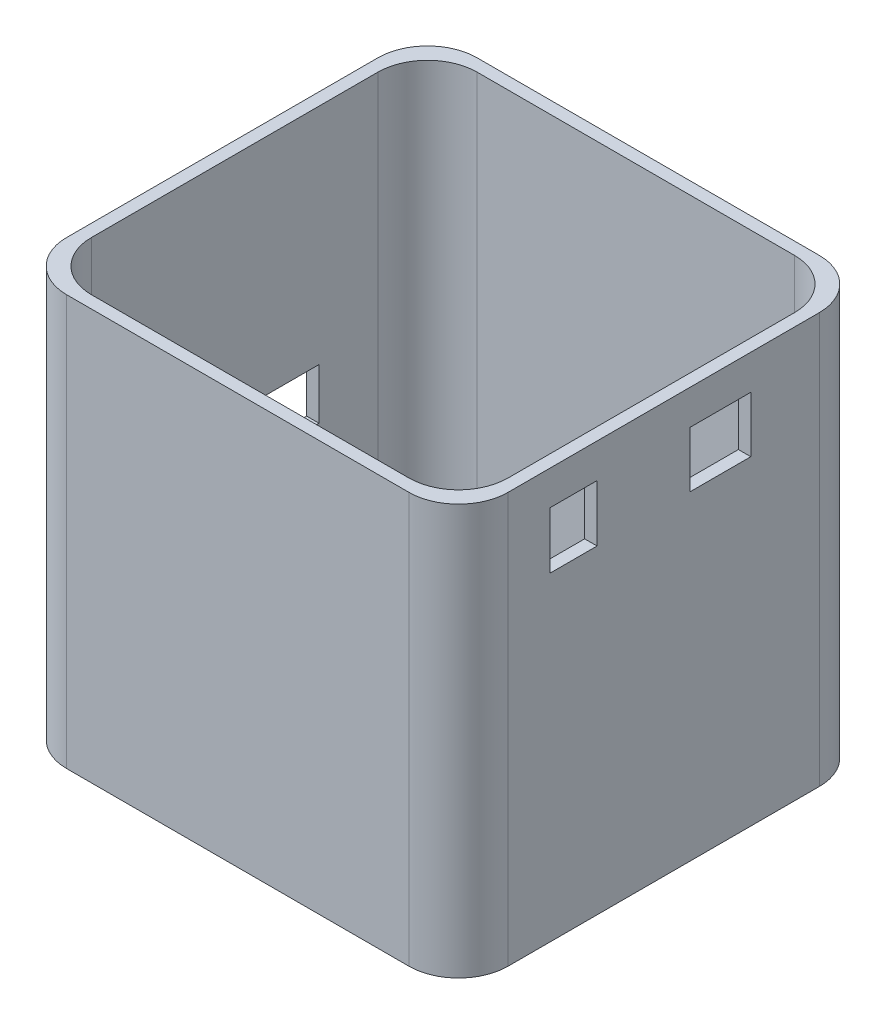
ISO-10303-21;
HEADER;
FILE_DESCRIPTION(('STEP AP214'),'2;1');
FILE_NAME('part.step','',(''),(''),'','','');
FILE_SCHEMA(('AUTOMOTIVE_DESIGN { 1 0 10303 214 1 1 1 1 }'));
ENDSEC;
DATA;
#1=APPLICATION_CONTEXT('core data for automotive mechanical design processes');
#2=APPLICATION_PROTOCOL_DEFINITION('international standard','automotive_design',2000,#1);
#3=PRODUCT_CONTEXT('',#1,'mechanical');
#4=PRODUCT('Part','Part','',(#3));
#5=PRODUCT_RELATED_PRODUCT_CATEGORY('part','',(#4));
#6=PRODUCT_DEFINITION_FORMATION('','',#4);
#7=PRODUCT_DEFINITION_CONTEXT('part definition',#1,'design');
#8=PRODUCT_DEFINITION('design','',#6,#7);
#9=PRODUCT_DEFINITION_SHAPE('','',#8);
#10=(LENGTH_UNIT() NAMED_UNIT(*) SI_UNIT(.MILLI.,.METRE.));
#11=(NAMED_UNIT(*) PLANE_ANGLE_UNIT() SI_UNIT($,.RADIAN.));
#12=(NAMED_UNIT(*) SI_UNIT($,.STERADIAN.) SOLID_ANGLE_UNIT());
#13=UNCERTAINTY_MEASURE_WITH_UNIT(LENGTH_MEASURE(1.E-05),#10,'distance_accuracy_value','');
#14=(GEOMETRIC_REPRESENTATION_CONTEXT(3) GLOBAL_UNCERTAINTY_ASSIGNED_CONTEXT((#13)) GLOBAL_UNIT_ASSIGNED_CONTEXT((#10,
#11,#12)) REPRESENTATION_CONTEXT('',''));
#15=CARTESIAN_POINT('',(0.,0.,0.));
#16=DIRECTION('',(0.,0.,1.));
#17=DIRECTION('',(1.,0.,0.));
#18=AXIS2_PLACEMENT_3D('',#15,#16,#17);
#19=CARTESIAN_POINT('',(45.212,84.074,42.037));
#20=DIRECTION('',(-1.,0.,0.));
#21=DIRECTION('',(0.,0.,1.));
#22=AXIS2_PLACEMENT_3D('',#19,#20,#21);
#23=PLANE('',#22);
#24=DIRECTION('',(0.,0.,-1.));
#25=VECTOR('',#24,1.);
#26=CARTESIAN_POINT('',(45.212,65.435704993454,23.3034092076323));
#27=LINE('',#26,#25);
#28=CARTESIAN_POINT('',(45.212,65.435704993454,23.3034092076323));
#29=VERTEX_POINT('',#28);
#30=CARTESIAN_POINT('',(45.212,65.435704993454,13.6514092076323));
#31=VERTEX_POINT('',#30);
#32=EDGE_CURVE('E238',#29,#31,#27,.T.);
#33=ORIENTED_EDGE('',*,*,#32,.F.);
#34=DIRECTION('',(0.,-1.,0.));
#35=VECTOR('',#34,1.);
#36=CARTESIAN_POINT('',(45.212,77.0442341176814,23.3034092076323));
#37=LINE('',#36,#35);
#38=CARTESIAN_POINT('',(45.212,77.0442341176814,23.3034092076323));
#39=VERTEX_POINT('',#38);
#40=EDGE_CURVE('E51',#39,#29,#37,.T.);
#41=ORIENTED_EDGE('',*,*,#40,.F.);
#42=DIRECTION('',(0.,0.,1.));
#43=VECTOR('',#42,1.);
#44=CARTESIAN_POINT('',(45.212,77.0442341176814,23.3034092076323));
#45=LINE('',#44,#43);
#46=CARTESIAN_POINT('',(45.212,77.0442341176814,13.6514092076323));
#47=VERTEX_POINT('',#46);
#48=EDGE_CURVE('E244',#47,#39,#45,.T.);
#49=ORIENTED_EDGE('',*,*,#48,.F.);
#50=DIRECTION('',(0.,1.,0.));
#51=VECTOR('',#50,1.);
#52=CARTESIAN_POINT('',(45.212,77.0442341176814,13.6514092076323));
#53=LINE('',#52,#51);
#54=EDGE_CURVE('E228',#31,#47,#53,.T.);
#55=ORIENTED_EDGE('',*,*,#54,.F.);
#56=EDGE_LOOP('',(#33,#41,#49,#55));
#57=FACE_BOUND('',#56,.T.);
#58=DIRECTION('',(0.,0.,-1.));
#59=VECTOR('',#58,1.);
#60=CARTESIAN_POINT('',(45.212,65.5321808304826,-5.39829426205587));
#61=LINE('',#60,#59);
#62=CARTESIAN_POINT('',(45.212,65.5321808304826,-5.39829426205587));
#63=VERTEX_POINT('',#62);
#64=CARTESIAN_POINT('',(45.212,65.5321808304826,-17.8442942620559));
#65=VERTEX_POINT('',#64);
#66=EDGE_CURVE('E255',#63,#65,#61,.T.);
#67=ORIENTED_EDGE('',*,*,#66,.F.);
#68=DIRECTION('',(0.,-1.,0.));
#69=VECTOR('',#68,1.);
#70=CARTESIAN_POINT('',(45.212,76.9621808304826,-5.39829426205586));
#71=LINE('',#70,#69);
#72=CARTESIAN_POINT('',(45.212,76.9621808304826,-5.39829426205586));
#73=VERTEX_POINT('',#72);
#74=EDGE_CURVE('E59',#73,#63,#71,.T.);
#75=ORIENTED_EDGE('',*,*,#74,.F.);
#76=DIRECTION('',(0.,0.,1.));
#77=VECTOR('',#76,1.);
#78=CARTESIAN_POINT('',(45.212,76.9621808304826,-5.39829426205586));
#79=LINE('',#78,#77);
#80=CARTESIAN_POINT('',(45.212,76.9621808304826,-17.8442942620559));
#81=VERTEX_POINT('',#80);
#82=EDGE_CURVE('E261',#81,#73,#79,.T.);
#83=ORIENTED_EDGE('',*,*,#82,.F.);
#84=DIRECTION('',(0.,1.,0.));
#85=VECTOR('',#84,1.);
#86=CARTESIAN_POINT('',(45.212,76.9621808304826,-17.8442942620559));
#87=LINE('',#86,#85);
#88=EDGE_CURVE('E258',#65,#81,#87,.T.);
#89=ORIENTED_EDGE('',*,*,#88,.F.);
#90=EDGE_LOOP('',(#67,#75,#83,#89));
#91=FACE_BOUND('',#90,.T.);
#92=DIRECTION('',(0.,0.,-1.));
#93=VECTOR('',#92,1.);
#94=CARTESIAN_POINT('',(45.212,84.074,42.037));
#95=LINE('',#94,#93);
#96=CARTESIAN_POINT('',(45.212,84.074,31.877));
#97=VERTEX_POINT('',#96);
#98=CARTESIAN_POINT('',(45.212,84.074,-31.877));
#99=VERTEX_POINT('',#98);
#100=EDGE_CURVE('E316',#97,#99,#95,.T.);
#101=ORIENTED_EDGE('',*,*,#100,.F.);
#102=DIRECTION('',(0.,-1.,0.));
#103=VECTOR('',#102,1.);
#104=CARTESIAN_POINT('',(45.212,84.074,31.877));
#105=LINE('',#104,#103);
#106=CARTESIAN_POINT('',(45.212,0.,31.877));
#107=VERTEX_POINT('',#106);
#108=EDGE_CURVE('E353',#97,#107,#105,.T.);
#109=ORIENTED_EDGE('',*,*,#108,.T.);
#110=DIRECTION('',(0.,0.,-1.));
#111=VECTOR('',#110,1.);
#112=CARTESIAN_POINT('',(45.212,0.,42.037));
#113=LINE('',#112,#111);
#114=CARTESIAN_POINT('',(45.212,0.,-31.877));
#115=VERTEX_POINT('',#114);
#116=EDGE_CURVE('E305',#107,#115,#113,.T.);
#117=ORIENTED_EDGE('',*,*,#116,.T.);
#118=DIRECTION('',(0.,-1.,0.));
#119=VECTOR('',#118,1.);
#120=CARTESIAN_POINT('',(45.212,84.074,-31.877));
#121=LINE('',#120,#119);
#122=EDGE_CURVE('E351',#115,#99,#121,.F.);
#123=ORIENTED_EDGE('',*,*,#122,.T.);
#124=EDGE_LOOP('',(#101,#109,#117,#123));
#125=FACE_BOUND('',#124,.T.);
#126=ADVANCED_FACE('F36',(#57,#91,#125),#23,.F.);
#127=CARTESIAN_POINT('',(-45.212,84.074,-42.037));
#128=DIRECTION('',(0.,0.,1.));
#129=DIRECTION('',(1.,0.,0.));
#130=AXIS2_PLACEMENT_3D('',#127,#128,#129);
#131=PLANE('',#130);
#132=DIRECTION('',(-1.,0.,0.));
#133=VECTOR('',#132,1.);
#134=CARTESIAN_POINT('',(-45.212,84.074,-42.037));
#135=LINE('',#134,#133);
#136=CARTESIAN_POINT('',(35.052,84.074,-42.037));
#137=VERTEX_POINT('',#136);
#138=CARTESIAN_POINT('',(-35.052,84.074,-42.037));
#139=VERTEX_POINT('',#138);
#140=EDGE_CURVE('E319',#137,#139,#135,.T.);
#141=ORIENTED_EDGE('',*,*,#140,.F.);
#142=DIRECTION('',(0.,-1.,0.));
#143=VECTOR('',#142,1.);
#144=CARTESIAN_POINT('',(35.052,84.074,-42.037));
#145=LINE('',#144,#143);
#146=CARTESIAN_POINT('',(35.052,0.,-42.037));
#147=VERTEX_POINT('',#146);
#148=EDGE_CURVE('E371',#137,#147,#145,.T.);
#149=ORIENTED_EDGE('',*,*,#148,.T.);
#150=DIRECTION('',(-1.,0.,0.));
#151=VECTOR('',#150,1.);
#152=CARTESIAN_POINT('',(-45.212,0.,-42.037));
#153=LINE('',#152,#151);
#154=CARTESIAN_POINT('',(-35.052,0.,-42.037));
#155=VERTEX_POINT('',#154);
#156=EDGE_CURVE('E332',#147,#155,#153,.T.);
#157=ORIENTED_EDGE('',*,*,#156,.T.);
#158=DIRECTION('',(0.,-1.,0.));
#159=VECTOR('',#158,1.);
#160=CARTESIAN_POINT('',(-35.052,84.074,-42.037));
#161=LINE('',#160,#159);
#162=EDGE_CURVE('E369',#155,#139,#161,.F.);
#163=ORIENTED_EDGE('',*,*,#162,.T.);
#164=EDGE_LOOP('',(#141,#149,#157,#163));
#165=FACE_BOUND('',#164,.T.);
#166=ADVANCED_FACE('F459',(#165),#131,.F.);
#167=CARTESIAN_POINT('',(-45.212,84.074,42.037));
#168=DIRECTION('',(1.,0.,0.));
#169=DIRECTION('',(0.,0.,-1.));
#170=AXIS2_PLACEMENT_3D('',#167,#168,#169);
#171=PLANE('',#170);
#172=DIRECTION('',(0.,0.,-1.));
#173=VECTOR('',#172,1.);
#174=CARTESIAN_POINT('',(-45.212,38.227,-17.272));
#175=LINE('',#174,#173);
#176=CARTESIAN_POINT('',(-45.212,38.227,17.272));
#177=VERTEX_POINT('',#176);
#178=CARTESIAN_POINT('',(-45.212,38.227,-17.272));
#179=VERTEX_POINT('',#178);
#180=EDGE_CURVE('E273',#177,#179,#175,.T.);
#181=ORIENTED_EDGE('',*,*,#180,.F.);
#182=DIRECTION('',(0.,1.,0.));
#183=VECTOR('',#182,1.);
#184=CARTESIAN_POINT('',(-45.212,27.813,17.272));
#185=LINE('',#184,#183);
#186=CARTESIAN_POINT('',(-45.212,27.813,17.272));
#187=VERTEX_POINT('',#186);
#188=EDGE_CURVE('E251',#187,#177,#185,.T.);
#189=ORIENTED_EDGE('',*,*,#188,.F.);
#190=DIRECTION('',(0.,0.,1.));
#191=VECTOR('',#190,1.);
#192=CARTESIAN_POINT('',(-45.212,27.813,-17.272));
#193=LINE('',#192,#191);
#194=CARTESIAN_POINT('',(-45.212,27.813,-17.272));
#195=VERTEX_POINT('',#194);
#196=EDGE_CURVE('E279',#195,#187,#193,.T.);
#197=ORIENTED_EDGE('',*,*,#196,.F.);
#198=DIRECTION('',(0.,-1.,0.));
#199=VECTOR('',#198,1.);
#200=CARTESIAN_POINT('',(-45.212,27.813,-17.272));
#201=LINE('',#200,#199);
#202=EDGE_CURVE('E276',#179,#195,#201,.T.);
#203=ORIENTED_EDGE('',*,*,#202,.F.);
#204=EDGE_LOOP('',(#181,#189,#197,#203));
#205=FACE_BOUND('',#204,.T.);
#206=DIRECTION('',(0.,0.,1.));
#207=VECTOR('',#206,1.);
#208=CARTESIAN_POINT('',(-45.212,84.074,42.037));
#209=LINE('',#208,#207);
#210=CARTESIAN_POINT('',(-45.212,84.074,-31.877));
#211=VERTEX_POINT('',#210);
#212=CARTESIAN_POINT('',(-45.212,84.074,31.877));
#213=VERTEX_POINT('',#212);
#214=EDGE_CURVE('E323',#211,#213,#209,.T.);
#215=ORIENTED_EDGE('',*,*,#214,.F.);
#216=DIRECTION('',(0.,-1.,0.));
#217=VECTOR('',#216,1.);
#218=CARTESIAN_POINT('',(-45.212,84.074,-31.877));
#219=LINE('',#218,#217);
#220=CARTESIAN_POINT('',(-45.212,0.,-31.877));
#221=VERTEX_POINT('',#220);
#222=EDGE_CURVE('E376',#211,#221,#219,.T.);
#223=ORIENTED_EDGE('',*,*,#222,.T.);
#224=DIRECTION('',(0.,0.,1.));
#225=VECTOR('',#224,1.);
#226=CARTESIAN_POINT('',(-45.212,0.,42.037));
#227=LINE('',#226,#225);
#228=CARTESIAN_POINT('',(-45.212,0.,31.877));
#229=VERTEX_POINT('',#228);
#230=EDGE_CURVE('E335',#221,#229,#227,.T.);
#231=ORIENTED_EDGE('',*,*,#230,.T.);
#232=DIRECTION('',(0.,-1.,0.));
#233=VECTOR('',#232,1.);
#234=CARTESIAN_POINT('',(-45.212,84.074,31.877));
#235=LINE('',#234,#233);
#236=EDGE_CURVE('E374',#229,#213,#235,.F.);
#237=ORIENTED_EDGE('',*,*,#236,.T.);
#238=EDGE_LOOP('',(#215,#223,#231,#237));
#239=FACE_BOUND('',#238,.T.);
#240=ADVANCED_FACE('F464',(#205,#239),#171,.F.);
#241=CARTESIAN_POINT('',(-45.212,84.074,42.037));
#242=DIRECTION('',(0.,0.,-1.));
#243=DIRECTION('',(-1.,0.,0.));
#244=AXIS2_PLACEMENT_3D('',#241,#242,#243);
#245=PLANE('',#244);
#246=DIRECTION('',(1.,0.,0.));
#247=VECTOR('',#246,1.);
#248=CARTESIAN_POINT('',(-45.212,0.,42.037));
#249=LINE('',#248,#247);
#250=CARTESIAN_POINT('',(-35.052,0.,42.037));
#251=VERTEX_POINT('',#250);
#252=CARTESIAN_POINT('',(35.052,0.,42.037));
#253=VERTEX_POINT('',#252);
#254=EDGE_CURVE('E320',#251,#253,#249,.T.);
#255=ORIENTED_EDGE('',*,*,#254,.T.);
#256=DIRECTION('',(0.,-1.,0.));
#257=VECTOR('',#256,1.);
#258=CARTESIAN_POINT('',(35.052,84.074,42.037));
#259=LINE('',#258,#257);
#260=CARTESIAN_POINT('',(35.052,84.074,42.037));
#261=VERTEX_POINT('',#260);
#262=EDGE_CURVE('E367',#253,#261,#259,.F.);
#263=ORIENTED_EDGE('',*,*,#262,.T.);
#264=DIRECTION('',(1.,0.,0.));
#265=VECTOR('',#264,1.);
#266=CARTESIAN_POINT('',(-45.212,84.074,42.037));
#267=LINE('',#266,#265);
#268=CARTESIAN_POINT('',(-35.052,84.074,42.037));
#269=VERTEX_POINT('',#268);
#270=EDGE_CURVE('E326',#269,#261,#267,.T.);
#271=ORIENTED_EDGE('',*,*,#270,.F.);
#272=DIRECTION('',(0.,-1.,0.));
#273=VECTOR('',#272,1.);
#274=CARTESIAN_POINT('',(-35.052,84.074,42.037));
#275=LINE('',#274,#273);
#276=EDGE_CURVE('E364',#269,#251,#275,.T.);
#277=ORIENTED_EDGE('',*,*,#276,.T.);
#278=EDGE_LOOP('',(#255,#263,#271,#277));
#279=FACE_BOUND('',#278,.T.);
#280=ADVANCED_FACE('F535',(#279),#245,.F.);
#281=CARTESIAN_POINT('',(0.,84.074,0.));
#282=DIRECTION('',(0.,-1.,0.));
#283=DIRECTION('',(0.,0.,-1.));
#284=AXIS2_PLACEMENT_3D('',#281,#282,#283);
#285=PLANE('',#284);
#286=DIRECTION('',(-1.,0.,0.));
#287=VECTOR('',#286,1.);
#288=CARTESIAN_POINT('',(-42.672,84.074,-39.497));
#289=LINE('',#288,#287);
#290=CARTESIAN_POINT('',(32.512,84.074,-39.497));
#291=VERTEX_POINT('',#290);
#292=CARTESIAN_POINT('',(-32.512,84.074,-39.497));
#293=VERTEX_POINT('',#292);
#294=EDGE_CURVE('E308',#291,#293,#289,.T.);
#295=ORIENTED_EDGE('',*,*,#294,.F.);
#296=CARTESIAN_POINT('',(32.512,84.074,-29.337));
#297=DIRECTION('',(0.,-1.,0.));
#298=DIRECTION('',(0.,0.,-1.));
#299=AXIS2_PLACEMENT_3D('',#296,#297,#298);
#300=CIRCLE('',#299,10.16);
#301=CARTESIAN_POINT('',(42.672,84.074,-29.337));
#302=VERTEX_POINT('',#301);
#303=EDGE_CURVE('E411',#291,#302,#300,.T.);
#304=ORIENTED_EDGE('',*,*,#303,.T.);
#305=DIRECTION('',(0.,0.,-1.));
#306=VECTOR('',#305,1.);
#307=CARTESIAN_POINT('',(42.672,84.074,39.497));
#308=LINE('',#307,#306);
#309=CARTESIAN_POINT('',(42.672,84.074,29.337));
#310=VERTEX_POINT('',#309);
#311=EDGE_CURVE('E285',#310,#302,#308,.T.);
#312=ORIENTED_EDGE('',*,*,#311,.F.);
#313=CARTESIAN_POINT('',(32.512,84.074,29.337));
#314=DIRECTION('',(0.,-1.,0.));
#315=DIRECTION('',(0.,0.,-1.));
#316=AXIS2_PLACEMENT_3D('',#313,#314,#315);
#317=CIRCLE('',#316,10.16);
#318=CARTESIAN_POINT('',(32.512,84.074,39.497));
#319=VERTEX_POINT('',#318);
#320=EDGE_CURVE('E407',#310,#319,#317,.T.);
#321=ORIENTED_EDGE('',*,*,#320,.T.);
#322=DIRECTION('',(1.,0.,0.));
#323=VECTOR('',#322,1.);
#324=CARTESIAN_POINT('',(-42.672,84.074,39.497));
#325=LINE('',#324,#323);
#326=CARTESIAN_POINT('',(-32.512,84.074,39.497));
#327=VERTEX_POINT('',#326);
#328=EDGE_CURVE('E296',#327,#319,#325,.T.);
#329=ORIENTED_EDGE('',*,*,#328,.F.);
#330=CARTESIAN_POINT('',(-32.512,84.074,29.337));
#331=DIRECTION('',(0.,-1.,0.));
#332=DIRECTION('',(0.,0.,-1.));
#333=AXIS2_PLACEMENT_3D('',#330,#331,#332);
#334=CIRCLE('',#333,10.16);
#335=CARTESIAN_POINT('',(-42.672,84.074,29.337));
#336=VERTEX_POINT('',#335);
#337=EDGE_CURVE('E409',#327,#336,#334,.T.);
#338=ORIENTED_EDGE('',*,*,#337,.T.);
#339=DIRECTION('',(0.,0.,1.));
#340=VECTOR('',#339,1.);
#341=CARTESIAN_POINT('',(-42.672,84.074,39.497));
#342=LINE('',#341,#340);
#343=CARTESIAN_POINT('',(-42.672,84.074,-29.337));
#344=VERTEX_POINT('',#343);
#345=EDGE_CURVE('E311',#344,#336,#342,.T.);
#346=ORIENTED_EDGE('',*,*,#345,.F.);
#347=CARTESIAN_POINT('',(-32.512,84.074,-29.337));
#348=DIRECTION('',(0.,-1.,0.));
#349=DIRECTION('',(0.,0.,-1.));
#350=AXIS2_PLACEMENT_3D('',#347,#348,#349);
#351=CIRCLE('',#350,10.16);
#352=EDGE_CURVE('E413',#344,#293,#351,.T.);
#353=ORIENTED_EDGE('',*,*,#352,.T.);
#354=EDGE_LOOP('',(#295,#304,#312,#321,#329,#338,#346,#353));
#355=FACE_BOUND('',#354,.T.);
#356=ORIENTED_EDGE('',*,*,#270,.T.);
#357=CARTESIAN_POINT('',(35.052,84.074,31.877));
#358=DIRECTION('',(0.,-1.,0.));
#359=DIRECTION('',(0.,0.,-1.));
#360=AXIS2_PLACEMENT_3D('',#357,#358,#359);
#361=CIRCLE('',#360,10.16);
#362=EDGE_CURVE('E421',#261,#97,#361,.F.);
#363=ORIENTED_EDGE('',*,*,#362,.T.);
#364=ORIENTED_EDGE('',*,*,#100,.T.);
#365=CARTESIAN_POINT('',(35.052,84.074,-31.877));
#366=DIRECTION('',(0.,-1.,0.));
#367=DIRECTION('',(0.,0.,-1.));
#368=AXIS2_PLACEMENT_3D('',#365,#366,#367);
#369=CIRCLE('',#368,10.16);
#370=EDGE_CURVE('E419',#99,#137,#369,.F.);
#371=ORIENTED_EDGE('',*,*,#370,.T.);
#372=ORIENTED_EDGE('',*,*,#140,.T.);
#373=CARTESIAN_POINT('',(-35.052,84.074,-31.877));
#374=DIRECTION('',(0.,-1.,0.));
#375=DIRECTION('',(0.,0.,-1.));
#376=AXIS2_PLACEMENT_3D('',#373,#374,#375);
#377=CIRCLE('',#376,10.16);
#378=EDGE_CURVE('E417',#139,#211,#377,.F.);
#379=ORIENTED_EDGE('',*,*,#378,.T.);
#380=ORIENTED_EDGE('',*,*,#214,.T.);
#381=CARTESIAN_POINT('',(-35.052,84.074,31.877));
#382=DIRECTION('',(0.,-1.,0.));
#383=DIRECTION('',(0.,0.,-1.));
#384=AXIS2_PLACEMENT_3D('',#381,#382,#383);
#385=CIRCLE('',#384,10.16);
#386=EDGE_CURVE('E415',#213,#269,#385,.F.);
#387=ORIENTED_EDGE('',*,*,#386,.T.);
#388=EDGE_LOOP('',(#356,#363,#364,#371,#372,#379,#380,#387));
#389=FACE_BOUND('',#388,.T.);
#390=ADVANCED_FACE('F531',(#355,#389),#285,.F.);
#391=CARTESIAN_POINT('',(0.,0.,0.));
#392=DIRECTION('',(0.,-1.,0.));
#393=DIRECTION('',(0.,0.,-1.));
#394=AXIS2_PLACEMENT_3D('',#391,#392,#393);
#395=PLANE('',#394);
#396=ORIENTED_EDGE('',*,*,#116,.F.);
#397=CARTESIAN_POINT('',(35.052,0.,31.877));
#398=DIRECTION('',(0.,-1.,0.));
#399=DIRECTION('',(0.,0.,-1.));
#400=AXIS2_PLACEMENT_3D('',#397,#398,#399);
#401=CIRCLE('',#400,10.16);
#402=EDGE_CURVE('E362',#107,#253,#401,.T.);
#403=ORIENTED_EDGE('',*,*,#402,.T.);
#404=ORIENTED_EDGE('',*,*,#254,.F.);
#405=CARTESIAN_POINT('',(-35.052,0.,31.877));
#406=DIRECTION('',(0.,-1.,0.));
#407=DIRECTION('',(0.,0.,-1.));
#408=AXIS2_PLACEMENT_3D('',#405,#406,#407);
#409=CIRCLE('',#408,10.16);
#410=EDGE_CURVE('E356',#251,#229,#409,.T.);
#411=ORIENTED_EDGE('',*,*,#410,.T.);
#412=ORIENTED_EDGE('',*,*,#230,.F.);
#413=CARTESIAN_POINT('',(-35.052,0.,-31.877));
#414=DIRECTION('',(0.,-1.,0.));
#415=DIRECTION('',(0.,0.,-1.));
#416=AXIS2_PLACEMENT_3D('',#413,#414,#415);
#417=CIRCLE('',#416,10.16);
#418=EDGE_CURVE('E358',#221,#155,#417,.T.);
#419=ORIENTED_EDGE('',*,*,#418,.T.);
#420=ORIENTED_EDGE('',*,*,#156,.F.);
#421=CARTESIAN_POINT('',(35.052,0.,-31.877));
#422=DIRECTION('',(0.,-1.,0.));
#423=DIRECTION('',(0.,0.,-1.));
#424=AXIS2_PLACEMENT_3D('',#421,#422,#423);
#425=CIRCLE('',#424,10.16);
#426=EDGE_CURVE('E360',#147,#115,#425,.T.);
#427=ORIENTED_EDGE('',*,*,#426,.T.);
#428=EDGE_LOOP('',(#396,#403,#404,#411,#412,#419,#420,#427));
#429=FACE_BOUND('',#428,.T.);
#430=ADVANCED_FACE('F534',(#429),#395,.T.);
#431=CARTESIAN_POINT('',(42.672,2.54,39.497));
#432=DIRECTION('',(1.,0.,0.));
#433=DIRECTION('',(0.,0.,-1.));
#434=AXIS2_PLACEMENT_3D('',#431,#432,#433);
#435=PLANE('',#434);
#436=DIRECTION('',(0.,0.,1.));
#437=VECTOR('',#436,1.);
#438=CARTESIAN_POINT('',(42.672,77.0442341176814,39.497));
#439=LINE('',#438,#437);
#440=CARTESIAN_POINT('',(42.672,77.0442341176814,13.6514092076323));
#441=VERTEX_POINT('',#440);
#442=CARTESIAN_POINT('',(42.672,77.0442341176814,23.3034092076323));
#443=VERTEX_POINT('',#442);
#444=EDGE_CURVE('E44',#441,#443,#439,.T.);
#445=ORIENTED_EDGE('',*,*,#444,.T.);
#446=DIRECTION('',(0.,-1.,0.));
#447=VECTOR('',#446,1.);
#448=CARTESIAN_POINT('',(42.672,2.54,23.3034092076323));
#449=LINE('',#448,#447);
#450=CARTESIAN_POINT('',(42.672,65.435704993454,23.3034092076323));
#451=VERTEX_POINT('',#450);
#452=EDGE_CURVE('E11',#443,#451,#449,.T.);
#453=ORIENTED_EDGE('',*,*,#452,.T.);
#454=DIRECTION('',(0.,0.,-1.));
#455=VECTOR('',#454,1.);
#456=CARTESIAN_POINT('',(42.672,65.435704993454,39.497));
#457=LINE('',#456,#455);
#458=CARTESIAN_POINT('',(42.672,65.435704993454,13.6514092076323));
#459=VERTEX_POINT('',#458);
#460=EDGE_CURVE('E435',#451,#459,#457,.T.);
#461=ORIENTED_EDGE('',*,*,#460,.T.);
#462=DIRECTION('',(0.,1.,0.));
#463=VECTOR('',#462,1.);
#464=CARTESIAN_POINT('',(42.672,2.54000000000001,13.6514092076322));
#465=LINE('',#464,#463);
#466=EDGE_CURVE('E231',#459,#441,#465,.T.);
#467=ORIENTED_EDGE('',*,*,#466,.T.);
#468=EDGE_LOOP('',(#445,#453,#461,#467));
#469=FACE_BOUND('',#468,.T.);
#470=DIRECTION('',(0.,0.,1.));
#471=VECTOR('',#470,1.);
#472=CARTESIAN_POINT('',(42.672,76.9621808304826,39.497));
#473=LINE('',#472,#471);
#474=CARTESIAN_POINT('',(42.672,76.9621808304826,-17.8442942620559));
#475=VERTEX_POINT('',#474);
#476=CARTESIAN_POINT('',(42.672,76.9621808304826,-5.39829426205586));
#477=VERTEX_POINT('',#476);
#478=EDGE_CURVE('E429',#475,#477,#473,.T.);
#479=ORIENTED_EDGE('',*,*,#478,.T.);
#480=DIRECTION('',(0.,-1.,0.));
#481=VECTOR('',#480,1.);
#482=CARTESIAN_POINT('',(42.672,2.54000000000001,-5.39829426205588));
#483=LINE('',#482,#481);
#484=CARTESIAN_POINT('',(42.672,65.5321808304826,-5.39829426205587));
#485=VERTEX_POINT('',#484);
#486=EDGE_CURVE('E432',#477,#485,#483,.T.);
#487=ORIENTED_EDGE('',*,*,#486,.T.);
#488=DIRECTION('',(0.,0.,-1.));
#489=VECTOR('',#488,1.);
#490=CARTESIAN_POINT('',(42.672,65.5321808304826,39.497));
#491=LINE('',#490,#489);
#492=CARTESIAN_POINT('',(42.672,65.5321808304826,-17.8442942620559));
#493=VERTEX_POINT('',#492);
#494=EDGE_CURVE('E423',#485,#493,#491,.T.);
#495=ORIENTED_EDGE('',*,*,#494,.T.);
#496=DIRECTION('',(0.,1.,0.));
#497=VECTOR('',#496,1.);
#498=CARTESIAN_POINT('',(42.672,2.54000000000002,-17.8442942620559));
#499=LINE('',#498,#497);
#500=EDGE_CURVE('E426',#493,#475,#499,.T.);
#501=ORIENTED_EDGE('',*,*,#500,.T.);
#502=EDGE_LOOP('',(#479,#487,#495,#501));
#503=FACE_BOUND('',#502,.T.);
#504=DIRECTION('',(0.,0.,-1.));
#505=VECTOR('',#504,1.);
#506=CARTESIAN_POINT('',(42.672,2.54,39.497));
#507=LINE('',#506,#505);
#508=CARTESIAN_POINT('',(42.672,2.54,29.337));
#509=VERTEX_POINT('',#508);
#510=CARTESIAN_POINT('',(42.672,2.54,-29.337));
#511=VERTEX_POINT('',#510);
#512=EDGE_CURVE('E292',#509,#511,#507,.T.);
#513=ORIENTED_EDGE('',*,*,#512,.F.);
#514=DIRECTION('',(0.,1.,0.));
#515=VECTOR('',#514,1.);
#516=CARTESIAN_POINT('',(42.672,84.074,29.337));
#517=LINE('',#516,#515);
#518=EDGE_CURVE('E381',#509,#310,#517,.T.);
#519=ORIENTED_EDGE('',*,*,#518,.T.);
#520=ORIENTED_EDGE('',*,*,#311,.T.);
#521=DIRECTION('',(0.,1.,0.));
#522=VECTOR('',#521,1.);
#523=CARTESIAN_POINT('',(42.672,2.54,-29.337));
#524=LINE('',#523,#522);
#525=EDGE_CURVE('E379',#302,#511,#524,.F.);
#526=ORIENTED_EDGE('',*,*,#525,.T.);
#527=EDGE_LOOP('',(#513,#519,#520,#526));
#528=FACE_BOUND('',#527,.T.);
#529=ADVANCED_FACE('F439',(#469,#503,#528),#435,.F.);
#530=CARTESIAN_POINT('',(-42.672,2.54,39.497));
#531=DIRECTION('',(0.,0.,1.));
#532=DIRECTION('',(1.,0.,0.));
#533=AXIS2_PLACEMENT_3D('',#530,#531,#532);
#534=PLANE('',#533);
#535=ORIENTED_EDGE('',*,*,#328,.T.);
#536=DIRECTION('',(0.,1.,0.));
#537=VECTOR('',#536,1.);
#538=CARTESIAN_POINT('',(32.512,2.54,39.497));
#539=LINE('',#538,#537);
#540=CARTESIAN_POINT('',(32.512,2.54,39.497));
#541=VERTEX_POINT('',#540);
#542=EDGE_CURVE('E387',#319,#541,#539,.F.);
#543=ORIENTED_EDGE('',*,*,#542,.T.);
#544=DIRECTION('',(1.,0.,0.));
#545=VECTOR('',#544,1.);
#546=CARTESIAN_POINT('',(-42.672,2.54,39.497));
#547=LINE('',#546,#545);
#548=CARTESIAN_POINT('',(-32.512,2.54,39.497));
#549=VERTEX_POINT('',#548);
#550=EDGE_CURVE('E302',#549,#541,#547,.T.);
#551=ORIENTED_EDGE('',*,*,#550,.F.);
#552=DIRECTION('',(0.,1.,0.));
#553=VECTOR('',#552,1.);
#554=CARTESIAN_POINT('',(-32.512,84.074,39.497));
#555=LINE('',#554,#553);
#556=EDGE_CURVE('E384',#549,#327,#555,.T.);
#557=ORIENTED_EDGE('',*,*,#556,.T.);
#558=EDGE_LOOP('',(#535,#543,#551,#557));
#559=FACE_BOUND('',#558,.T.);
#560=ADVANCED_FACE('F524',(#559),#534,.F.);
#561=CARTESIAN_POINT('',(-42.672,2.54,39.497));
#562=DIRECTION('',(-1.,0.,0.));
#563=DIRECTION('',(0.,0.,1.));
#564=AXIS2_PLACEMENT_3D('',#561,#562,#563);
#565=PLANE('',#564);
#566=DIRECTION('',(0.,0.,1.));
#567=VECTOR('',#566,1.);
#568=CARTESIAN_POINT('',(-42.672,27.813,39.497));
#569=LINE('',#568,#567);
#570=CARTESIAN_POINT('',(-42.672,27.813,-17.272));
#571=VERTEX_POINT('',#570);
#572=CARTESIAN_POINT('',(-42.672,27.813,17.272));
#573=VERTEX_POINT('',#572);
#574=EDGE_CURVE('E345',#571,#573,#569,.T.);
#575=ORIENTED_EDGE('',*,*,#574,.T.);
#576=DIRECTION('',(0.,1.,0.));
#577=VECTOR('',#576,1.);
#578=CARTESIAN_POINT('',(-42.672,2.54,17.272));
#579=LINE('',#578,#577);
#580=CARTESIAN_POINT('',(-42.672,38.227,17.272));
#581=VERTEX_POINT('',#580);
#582=EDGE_CURVE('E348',#573,#581,#579,.T.);
#583=ORIENTED_EDGE('',*,*,#582,.T.);
#584=DIRECTION('',(0.,0.,-1.));
#585=VECTOR('',#584,1.);
#586=CARTESIAN_POINT('',(-42.672,38.227,39.497));
#587=LINE('',#586,#585);
#588=CARTESIAN_POINT('',(-42.672,38.227,-17.272));
#589=VERTEX_POINT('',#588);
#590=EDGE_CURVE('E329',#581,#589,#587,.T.);
#591=ORIENTED_EDGE('',*,*,#590,.T.);
#592=DIRECTION('',(0.,-1.,0.));
#593=VECTOR('',#592,1.);
#594=CARTESIAN_POINT('',(-42.672,2.54,-17.272));
#595=LINE('',#594,#593);
#596=EDGE_CURVE('E342',#589,#571,#595,.T.);
#597=ORIENTED_EDGE('',*,*,#596,.T.);
#598=EDGE_LOOP('',(#575,#583,#591,#597));
#599=FACE_BOUND('',#598,.T.);
#600=ORIENTED_EDGE('',*,*,#345,.T.);
#601=DIRECTION('',(0.,1.,0.));
#602=VECTOR('',#601,1.);
#603=CARTESIAN_POINT('',(-42.672,2.54,29.337));
#604=LINE('',#603,#602);
#605=CARTESIAN_POINT('',(-42.672,2.54,29.337));
#606=VERTEX_POINT('',#605);
#607=EDGE_CURVE('E400',#336,#606,#604,.F.);
#608=ORIENTED_EDGE('',*,*,#607,.T.);
#609=DIRECTION('',(0.,0.,1.));
#610=VECTOR('',#609,1.);
#611=CARTESIAN_POINT('',(-42.672,2.54,39.497));
#612=LINE('',#611,#610);
#613=CARTESIAN_POINT('',(-42.672,2.54,-29.337));
#614=VERTEX_POINT('',#613);
#615=EDGE_CURVE('E299',#614,#606,#612,.T.);
#616=ORIENTED_EDGE('',*,*,#615,.F.);
#617=DIRECTION('',(0.,1.,0.));
#618=VECTOR('',#617,1.);
#619=CARTESIAN_POINT('',(-42.672,84.074,-29.337));
#620=LINE('',#619,#618);
#621=EDGE_CURVE('E397',#614,#344,#620,.T.);
#622=ORIENTED_EDGE('',*,*,#621,.T.);
#623=EDGE_LOOP('',(#600,#608,#616,#622));
#624=FACE_BOUND('',#623,.T.);
#625=ADVANCED_FACE('F517',(#599,#624),#565,.F.);
#626=CARTESIAN_POINT('',(-42.672,2.54,-39.497));
#627=DIRECTION('',(0.,0.,-1.));
#628=DIRECTION('',(-1.,0.,0.));
#629=AXIS2_PLACEMENT_3D('',#626,#627,#628);
#630=PLANE('',#629);
#631=DIRECTION('',(-1.,0.,0.));
#632=VECTOR('',#631,1.);
#633=CARTESIAN_POINT('',(-42.672,2.54,-39.497));
#634=LINE('',#633,#632);
#635=CARTESIAN_POINT('',(32.512,2.54,-39.497));
#636=VERTEX_POINT('',#635);
#637=CARTESIAN_POINT('',(-32.512,2.54,-39.497));
#638=VERTEX_POINT('',#637);
#639=EDGE_CURVE('E295',#636,#638,#634,.T.);
#640=ORIENTED_EDGE('',*,*,#639,.F.);
#641=DIRECTION('',(0.,1.,0.));
#642=VECTOR('',#641,1.);
#643=CARTESIAN_POINT('',(32.512,84.074,-39.497));
#644=LINE('',#643,#642);
#645=EDGE_CURVE('E404',#636,#291,#644,.T.);
#646=ORIENTED_EDGE('',*,*,#645,.T.);
#647=ORIENTED_EDGE('',*,*,#294,.T.);
#648=DIRECTION('',(0.,1.,0.));
#649=VECTOR('',#648,1.);
#650=CARTESIAN_POINT('',(-32.512,2.54,-39.497));
#651=LINE('',#650,#649);
#652=EDGE_CURVE('E402',#293,#638,#651,.F.);
#653=ORIENTED_EDGE('',*,*,#652,.T.);
#654=EDGE_LOOP('',(#640,#646,#647,#653));
#655=FACE_BOUND('',#654,.T.);
#656=ADVANCED_FACE('F510',(#655),#630,.F.);
#657=CARTESIAN_POINT('',(0.,2.54,0.));
#658=DIRECTION('',(0.,-1.,0.));
#659=DIRECTION('',(0.,0.,-1.));
#660=AXIS2_PLACEMENT_3D('',#657,#658,#659);
#661=PLANE('',#660);
#662=ORIENTED_EDGE('',*,*,#550,.T.);
#663=CARTESIAN_POINT('',(32.512,2.54,29.337));
#664=DIRECTION('',(0.,-1.,0.));
#665=DIRECTION('',(0.,0.,-1.));
#666=AXIS2_PLACEMENT_3D('',#663,#664,#665);
#667=CIRCLE('',#666,10.16);
#668=EDGE_CURVE('E395',#541,#509,#667,.F.);
#669=ORIENTED_EDGE('',*,*,#668,.T.);
#670=ORIENTED_EDGE('',*,*,#512,.T.);
#671=CARTESIAN_POINT('',(32.512,2.54,-29.337));
#672=DIRECTION('',(0.,-1.,0.));
#673=DIRECTION('',(0.,0.,-1.));
#674=AXIS2_PLACEMENT_3D('',#671,#672,#673);
#675=CIRCLE('',#674,10.16);
#676=EDGE_CURVE('E391',#511,#636,#675,.F.);
#677=ORIENTED_EDGE('',*,*,#676,.T.);
#678=ORIENTED_EDGE('',*,*,#639,.T.);
#679=CARTESIAN_POINT('',(-32.512,2.54,-29.337));
#680=DIRECTION('',(0.,-1.,0.));
#681=DIRECTION('',(0.,0.,-1.));
#682=AXIS2_PLACEMENT_3D('',#679,#680,#681);
#683=CIRCLE('',#682,10.16);
#684=EDGE_CURVE('E389',#638,#614,#683,.F.);
#685=ORIENTED_EDGE('',*,*,#684,.T.);
#686=ORIENTED_EDGE('',*,*,#615,.T.);
#687=CARTESIAN_POINT('',(-32.512,2.54,29.337));
#688=DIRECTION('',(0.,-1.,0.));
#689=DIRECTION('',(0.,0.,-1.));
#690=AXIS2_PLACEMENT_3D('',#687,#688,#689);
#691=CIRCLE('',#690,10.16);
#692=EDGE_CURVE('E393',#606,#549,#691,.F.);
#693=ORIENTED_EDGE('',*,*,#692,.T.);
#694=EDGE_LOOP('',(#662,#669,#670,#677,#678,#685,#686,#693));
#695=FACE_BOUND('',#694,.T.);
#696=ADVANCED_FACE('F506',(#695),#661,.F.);
#697=CARTESIAN_POINT('',(-37.592,27.813,17.272));
#698=DIRECTION('',(0.,0.,1.));
#699=DIRECTION('',(1.,0.,0.));
#700=AXIS2_PLACEMENT_3D('',#697,#698,#699);
#701=PLANE('',#700);
#702=DIRECTION('',(-1.,0.,0.));
#703=VECTOR('',#702,1.);
#704=CARTESIAN_POINT('',(-37.592,27.813,17.272));
#705=LINE('',#704,#703);
#706=EDGE_CURVE('E283',#573,#187,#705,.T.);
#707=ORIENTED_EDGE('',*,*,#706,.T.);
#708=ORIENTED_EDGE('',*,*,#188,.T.);
#709=DIRECTION('',(-1.,0.,0.));
#710=VECTOR('',#709,1.);
#711=CARTESIAN_POINT('',(-37.592,38.227,17.272));
#712=LINE('',#711,#710);
#713=EDGE_CURVE('E282',#581,#177,#712,.T.);
#714=ORIENTED_EDGE('',*,*,#713,.F.);
#715=ORIENTED_EDGE('',*,*,#582,.F.);
#716=EDGE_LOOP('',(#707,#708,#714,#715));
#717=FACE_BOUND('',#716,.T.);
#718=ADVANCED_FACE('F581',(#717),#701,.F.);
#719=CARTESIAN_POINT('',(-37.592,27.813,-17.272));
#720=DIRECTION('',(0.,-1.,0.));
#721=DIRECTION('',(0.,0.,-1.));
#722=AXIS2_PLACEMENT_3D('',#719,#720,#721);
#723=PLANE('',#722);
#724=DIRECTION('',(-1.,0.,0.));
#725=VECTOR('',#724,1.);
#726=CARTESIAN_POINT('',(-37.592,27.813,-17.272));
#727=LINE('',#726,#725);
#728=EDGE_CURVE('E286',#571,#195,#727,.T.);
#729=ORIENTED_EDGE('',*,*,#728,.T.);
#730=ORIENTED_EDGE('',*,*,#196,.T.);
#731=ORIENTED_EDGE('',*,*,#706,.F.);
#732=ORIENTED_EDGE('',*,*,#574,.F.);
#733=EDGE_LOOP('',(#729,#730,#731,#732));
#734=FACE_BOUND('',#733,.T.);
#735=ADVANCED_FACE('F584',(#734),#723,.F.);
#736=CARTESIAN_POINT('',(-37.592,27.813,-17.272));
#737=DIRECTION('',(0.,0.,-1.));
#738=DIRECTION('',(-1.,0.,0.));
#739=AXIS2_PLACEMENT_3D('',#736,#737,#738);
#740=PLANE('',#739);
#741=DIRECTION('',(-1.,0.,0.));
#742=VECTOR('',#741,1.);
#743=CARTESIAN_POINT('',(-37.592,38.227,-17.272));
#744=LINE('',#743,#742);
#745=EDGE_CURVE('E288',#589,#179,#744,.T.);
#746=ORIENTED_EDGE('',*,*,#745,.T.);
#747=ORIENTED_EDGE('',*,*,#202,.T.);
#748=ORIENTED_EDGE('',*,*,#728,.F.);
#749=ORIENTED_EDGE('',*,*,#596,.F.);
#750=EDGE_LOOP('',(#746,#747,#748,#749));
#751=FACE_BOUND('',#750,.T.);
#752=ADVANCED_FACE('F588',(#751),#740,.F.);
#753=CARTESIAN_POINT('',(-37.592,38.227,-17.272));
#754=DIRECTION('',(0.,1.,0.));
#755=DIRECTION('',(0.,0.,1.));
#756=AXIS2_PLACEMENT_3D('',#753,#754,#755);
#757=PLANE('',#756);
#758=ORIENTED_EDGE('',*,*,#713,.T.);
#759=ORIENTED_EDGE('',*,*,#180,.T.);
#760=ORIENTED_EDGE('',*,*,#745,.F.);
#761=ORIENTED_EDGE('',*,*,#590,.F.);
#762=EDGE_LOOP('',(#758,#759,#760,#761));
#763=FACE_BOUND('',#762,.T.);
#764=ADVANCED_FACE('F473',(#763),#757,.F.);
#765=CARTESIAN_POINT('',(35.052,84.074,31.877));
#766=DIRECTION('',(0.,-1.,0.));
#767=DIRECTION('',(0.,0.,-1.));
#768=AXIS2_PLACEMENT_3D('',#765,#766,#767);
#769=CYLINDRICAL_SURFACE('',#768,10.16);
#770=ORIENTED_EDGE('',*,*,#362,.F.);
#771=ORIENTED_EDGE('',*,*,#262,.F.);
#772=ORIENTED_EDGE('',*,*,#402,.F.);
#773=ORIENTED_EDGE('',*,*,#108,.F.);
#774=EDGE_LOOP('',(#770,#771,#772,#773));
#775=FACE_BOUND('',#774,.T.);
#776=ADVANCED_FACE('F469',(#775),#769,.T.);
#777=CARTESIAN_POINT('',(35.052,84.074,-31.877));
#778=DIRECTION('',(0.,-1.,0.));
#779=DIRECTION('',(0.,0.,-1.));
#780=AXIS2_PLACEMENT_3D('',#777,#778,#779);
#781=CYLINDRICAL_SURFACE('',#780,10.16);
#782=ORIENTED_EDGE('',*,*,#370,.F.);
#783=ORIENTED_EDGE('',*,*,#122,.F.);
#784=ORIENTED_EDGE('',*,*,#426,.F.);
#785=ORIENTED_EDGE('',*,*,#148,.F.);
#786=EDGE_LOOP('',(#782,#783,#784,#785));
#787=FACE_BOUND('',#786,.T.);
#788=ADVANCED_FACE('F472',(#787),#781,.T.);
#789=CARTESIAN_POINT('',(-35.052,84.074,-31.877));
#790=DIRECTION('',(0.,-1.,0.));
#791=DIRECTION('',(0.,0.,-1.));
#792=AXIS2_PLACEMENT_3D('',#789,#790,#791);
#793=CYLINDRICAL_SURFACE('',#792,10.16);
#794=ORIENTED_EDGE('',*,*,#378,.F.);
#795=ORIENTED_EDGE('',*,*,#162,.F.);
#796=ORIENTED_EDGE('',*,*,#418,.F.);
#797=ORIENTED_EDGE('',*,*,#222,.F.);
#798=EDGE_LOOP('',(#794,#795,#796,#797));
#799=FACE_BOUND('',#798,.T.);
#800=ADVANCED_FACE('F477',(#799),#793,.T.);
#801=CARTESIAN_POINT('',(-35.052,84.074,31.877));
#802=DIRECTION('',(0.,-1.,0.));
#803=DIRECTION('',(0.,0.,-1.));
#804=AXIS2_PLACEMENT_3D('',#801,#802,#803);
#805=CYLINDRICAL_SURFACE('',#804,10.16);
#806=ORIENTED_EDGE('',*,*,#386,.F.);
#807=ORIENTED_EDGE('',*,*,#236,.F.);
#808=ORIENTED_EDGE('',*,*,#410,.F.);
#809=ORIENTED_EDGE('',*,*,#276,.F.);
#810=EDGE_LOOP('',(#806,#807,#808,#809));
#811=FACE_BOUND('',#810,.T.);
#812=ADVANCED_FACE('F481',(#811),#805,.T.);
#813=CARTESIAN_POINT('',(32.512,2.54,29.337));
#814=DIRECTION('',(0.,-1.,0.));
#815=DIRECTION('',(0.,0.,-1.));
#816=AXIS2_PLACEMENT_3D('',#813,#814,#815);
#817=CYLINDRICAL_SURFACE('',#816,10.16);
#818=ORIENTED_EDGE('',*,*,#668,.F.);
#819=ORIENTED_EDGE('',*,*,#542,.F.);
#820=ORIENTED_EDGE('',*,*,#320,.F.);
#821=ORIENTED_EDGE('',*,*,#518,.F.);
#822=EDGE_LOOP('',(#818,#819,#820,#821));
#823=FACE_BOUND('',#822,.T.);
#824=ADVANCED_FACE('F485',(#823),#817,.F.);
#825=CARTESIAN_POINT('',(-32.512,2.54,29.337));
#826=DIRECTION('',(0.,-1.,0.));
#827=DIRECTION('',(0.,0.,-1.));
#828=AXIS2_PLACEMENT_3D('',#825,#826,#827);
#829=CYLINDRICAL_SURFACE('',#828,10.16);
#830=ORIENTED_EDGE('',*,*,#692,.F.);
#831=ORIENTED_EDGE('',*,*,#607,.F.);
#832=ORIENTED_EDGE('',*,*,#337,.F.);
#833=ORIENTED_EDGE('',*,*,#556,.F.);
#834=EDGE_LOOP('',(#830,#831,#832,#833));
#835=FACE_BOUND('',#834,.T.);
#836=ADVANCED_FACE('F489',(#835),#829,.F.);
#837=CARTESIAN_POINT('',(32.512,2.54,-29.337));
#838=DIRECTION('',(0.,-1.,0.));
#839=DIRECTION('',(0.,0.,-1.));
#840=AXIS2_PLACEMENT_3D('',#837,#838,#839);
#841=CYLINDRICAL_SURFACE('',#840,10.16);
#842=ORIENTED_EDGE('',*,*,#676,.F.);
#843=ORIENTED_EDGE('',*,*,#525,.F.);
#844=ORIENTED_EDGE('',*,*,#303,.F.);
#845=ORIENTED_EDGE('',*,*,#645,.F.);
#846=EDGE_LOOP('',(#842,#843,#844,#845));
#847=FACE_BOUND('',#846,.T.);
#848=ADVANCED_FACE('F492',(#847),#841,.F.);
#849=CARTESIAN_POINT('',(-32.512,2.54,-29.337));
#850=DIRECTION('',(0.,-1.,0.));
#851=DIRECTION('',(0.,0.,-1.));
#852=AXIS2_PLACEMENT_3D('',#849,#850,#851);
#853=CYLINDRICAL_SURFACE('',#852,10.16);
#854=ORIENTED_EDGE('',*,*,#684,.F.);
#855=ORIENTED_EDGE('',*,*,#652,.F.);
#856=ORIENTED_EDGE('',*,*,#352,.F.);
#857=ORIENTED_EDGE('',*,*,#621,.F.);
#858=EDGE_LOOP('',(#854,#855,#856,#857));
#859=FACE_BOUND('',#858,.T.);
#860=ADVANCED_FACE('F38',(#859),#853,.F.);
#861=CARTESIAN_POINT('',(40.132,76.9621808304826,-5.39829426205586));
#862=DIRECTION('',(0.,0.,1.));
#863=DIRECTION('',(0.,-1.,0.));
#864=AXIS2_PLACEMENT_3D('',#861,#862,#863);
#865=PLANE('',#864);
#866=DIRECTION('',(1.,0.,0.));
#867=VECTOR('',#866,1.);
#868=CARTESIAN_POINT('',(40.132,76.9621808304826,-5.39829426205586));
#869=LINE('',#868,#867);
#870=EDGE_CURVE('E265',#477,#73,#869,.T.);
#871=ORIENTED_EDGE('',*,*,#870,.T.);
#872=ORIENTED_EDGE('',*,*,#74,.T.);
#873=DIRECTION('',(1.,0.,0.));
#874=VECTOR('',#873,1.);
#875=CARTESIAN_POINT('',(40.132,65.5321808304826,-5.39829426205587));
#876=LINE('',#875,#874);
#877=EDGE_CURVE('E264',#485,#63,#876,.T.);
#878=ORIENTED_EDGE('',*,*,#877,.F.);
#879=ORIENTED_EDGE('',*,*,#486,.F.);
#880=EDGE_LOOP('',(#871,#872,#878,#879));
#881=FACE_BOUND('',#880,.T.);
#882=ADVANCED_FACE('F499',(#881),#865,.F.);
#883=CARTESIAN_POINT('',(40.132,76.9621808304826,-5.39829426205586));
#884=DIRECTION('',(0.,1.,0.));
#885=DIRECTION('',(0.,0.,1.));
#886=AXIS2_PLACEMENT_3D('',#883,#884,#885);
#887=PLANE('',#886);
#888=DIRECTION('',(1.,0.,0.));
#889=VECTOR('',#888,1.);
#890=CARTESIAN_POINT('',(40.132,76.9621808304826,-17.8442942620559));
#891=LINE('',#890,#889);
#892=EDGE_CURVE('E267',#475,#81,#891,.T.);
#893=ORIENTED_EDGE('',*,*,#892,.T.);
#894=ORIENTED_EDGE('',*,*,#82,.T.);
#895=ORIENTED_EDGE('',*,*,#870,.F.);
#896=ORIENTED_EDGE('',*,*,#478,.F.);
#897=EDGE_LOOP('',(#893,#894,#895,#896));
#898=FACE_BOUND('',#897,.T.);
#899=ADVANCED_FACE('F597',(#898),#887,.F.);
#900=CARTESIAN_POINT('',(40.132,76.9621808304826,-17.8442942620559));
#901=DIRECTION('',(0.,0.,-1.));
#902=DIRECTION('',(0.,1.,0.));
#903=AXIS2_PLACEMENT_3D('',#900,#901,#902);
#904=PLANE('',#903);
#905=DIRECTION('',(1.,0.,0.));
#906=VECTOR('',#905,1.);
#907=CARTESIAN_POINT('',(40.132,65.5321808304826,-17.8442942620559));
#908=LINE('',#907,#906);
#909=EDGE_CURVE('E269',#493,#65,#908,.T.);
#910=ORIENTED_EDGE('',*,*,#909,.T.);
#911=ORIENTED_EDGE('',*,*,#88,.T.);
#912=ORIENTED_EDGE('',*,*,#892,.F.);
#913=ORIENTED_EDGE('',*,*,#500,.F.);
#914=EDGE_LOOP('',(#910,#911,#912,#913));
#915=FACE_BOUND('',#914,.T.);
#916=ADVANCED_FACE('F453',(#915),#904,.F.);
#917=CARTESIAN_POINT('',(40.132,65.5321808304826,-5.39829426205587));
#918=DIRECTION('',(0.,-1.,0.));
#919=DIRECTION('',(0.,0.,-1.));
#920=AXIS2_PLACEMENT_3D('',#917,#918,#919);
#921=PLANE('',#920);
#922=ORIENTED_EDGE('',*,*,#877,.T.);
#923=ORIENTED_EDGE('',*,*,#66,.T.);
#924=ORIENTED_EDGE('',*,*,#909,.F.);
#925=ORIENTED_EDGE('',*,*,#494,.F.);
#926=EDGE_LOOP('',(#922,#923,#924,#925));
#927=FACE_BOUND('',#926,.T.);
#928=ADVANCED_FACE('F446',(#927),#921,.F.);
#929=CARTESIAN_POINT('',(40.132,77.0442341176814,23.3034092076323));
#930=DIRECTION('',(0.,0.,1.));
#931=DIRECTION('',(1.,0.,0.));
#932=AXIS2_PLACEMENT_3D('',#929,#930,#931);
#933=PLANE('',#932);
#934=DIRECTION('',(1.,0.,0.));
#935=VECTOR('',#934,1.);
#936=CARTESIAN_POINT('',(40.132,77.0442341176814,23.3034092076323));
#937=LINE('',#936,#935);
#938=EDGE_CURVE('E249',#443,#39,#937,.T.);
#939=ORIENTED_EDGE('',*,*,#938,.T.);
#940=ORIENTED_EDGE('',*,*,#40,.T.);
#941=DIRECTION('',(1.,0.,0.));
#942=VECTOR('',#941,1.);
#943=CARTESIAN_POINT('',(40.132,65.435704993454,23.3034092076323));
#944=LINE('',#943,#942);
#945=EDGE_CURVE('E235',#451,#29,#944,.T.);
#946=ORIENTED_EDGE('',*,*,#945,.F.);
#947=ORIENTED_EDGE('',*,*,#452,.F.);
#948=EDGE_LOOP('',(#939,#940,#946,#947));
#949=FACE_BOUND('',#948,.T.);
#950=ADVANCED_FACE('F444',(#949),#933,.F.);
#951=CARTESIAN_POINT('',(40.132,77.0442341176814,23.3034092076323));
#952=DIRECTION('',(0.,1.,0.));
#953=DIRECTION('',(0.,0.,1.));
#954=AXIS2_PLACEMENT_3D('',#951,#952,#953);
#955=PLANE('',#954);
#956=DIRECTION('',(1.,0.,0.));
#957=VECTOR('',#956,1.);
#958=CARTESIAN_POINT('',(40.132,77.0442341176814,13.6514092076323));
#959=LINE('',#958,#957);
#960=EDGE_CURVE('E234',#441,#47,#959,.T.);
#961=ORIENTED_EDGE('',*,*,#960,.T.);
#962=ORIENTED_EDGE('',*,*,#48,.T.);
#963=ORIENTED_EDGE('',*,*,#938,.F.);
#964=ORIENTED_EDGE('',*,*,#444,.F.);
#965=EDGE_LOOP('',(#961,#962,#963,#964));
#966=FACE_BOUND('',#965,.T.);
#967=ADVANCED_FACE('F443',(#966),#955,.F.);
#968=CARTESIAN_POINT('',(40.132,77.0442341176814,13.6514092076323));
#969=DIRECTION('',(0.,0.,-1.));
#970=DIRECTION('',(0.,1.,0.));
#971=AXIS2_PLACEMENT_3D('',#968,#969,#970);
#972=PLANE('',#971);
#973=DIRECTION('',(1.,0.,0.));
#974=VECTOR('',#973,1.);
#975=CARTESIAN_POINT('',(40.132,65.435704993454,13.6514092076323));
#976=LINE('',#975,#974);
#977=EDGE_CURVE('E223',#459,#31,#976,.T.);
#978=ORIENTED_EDGE('',*,*,#977,.T.);
#979=ORIENTED_EDGE('',*,*,#54,.T.);
#980=ORIENTED_EDGE('',*,*,#960,.F.);
#981=ORIENTED_EDGE('',*,*,#466,.F.);
#982=EDGE_LOOP('',(#978,#979,#980,#981));
#983=FACE_BOUND('',#982,.T.);
#984=ADVANCED_FACE('F225',(#983),#972,.F.);
#985=CARTESIAN_POINT('',(40.132,65.435704993454,23.3034092076323));
#986=DIRECTION('',(0.,-1.,0.));
#987=DIRECTION('',(0.,0.,-1.));
#988=AXIS2_PLACEMENT_3D('',#985,#986,#987);
#989=PLANE('',#988);
#990=ORIENTED_EDGE('',*,*,#945,.T.);
#991=ORIENTED_EDGE('',*,*,#32,.T.);
#992=ORIENTED_EDGE('',*,*,#977,.F.);
#993=ORIENTED_EDGE('',*,*,#460,.F.);
#994=EDGE_LOOP('',(#990,#991,#992,#993));
#995=FACE_BOUND('',#994,.T.);
#996=ADVANCED_FACE('F239',(#995),#989,.F.);
#997=CLOSED_SHELL('',(#126,#166,#240,#280,#390,#430,#529,#560,#625,#656,#696,#718,#735,#752,
#764,#776,#788,#800,#812,#824,#836,#848,#860,#882,#899,#916,#928,#950,#967,#984,#996));
#998=MANIFOLD_SOLID_BREP('B2',#997);
#999=ADVANCED_BREP_SHAPE_REPRESENTATION('',(#18,#998),#14);
#1000=SHAPE_DEFINITION_REPRESENTATION(#9,#999);
ENDSEC;
END-ISO-10303-21;
